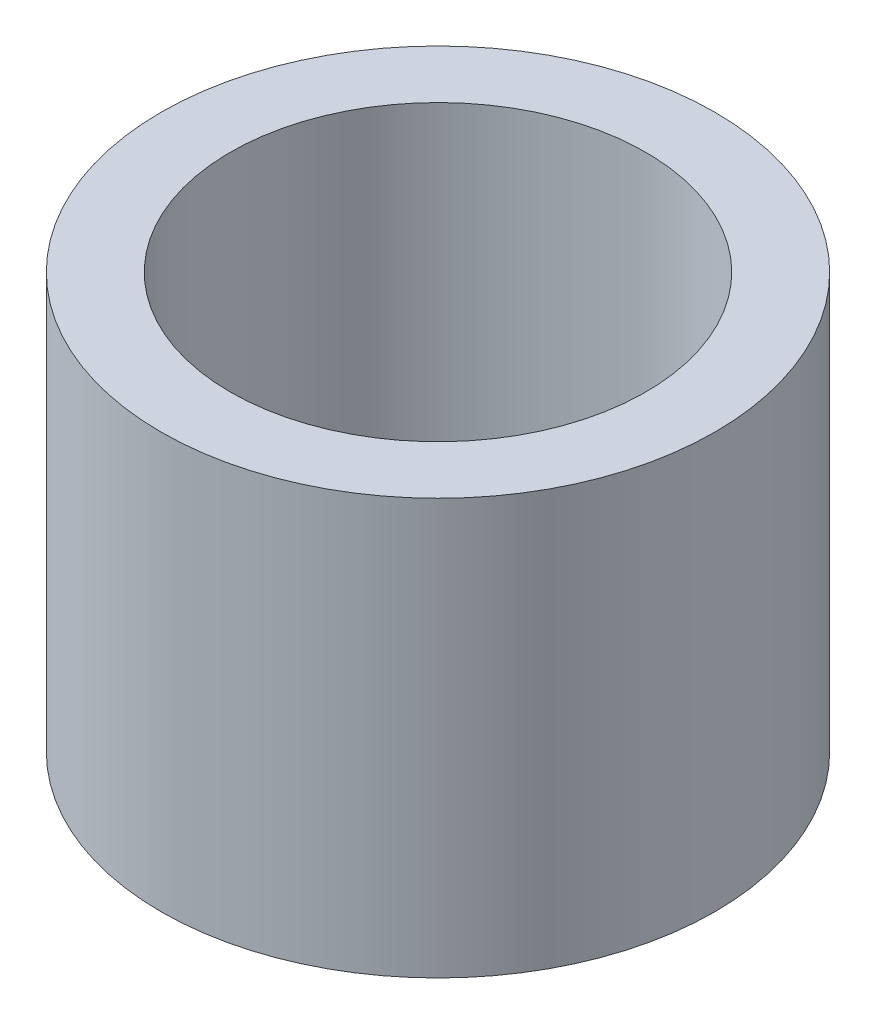
ISO-10303-21;
HEADER;
FILE_DESCRIPTION(('STEP AP214'),'2;1');
FILE_NAME('part.step','',(''),(''),'','','');
FILE_SCHEMA(('AUTOMOTIVE_DESIGN { 1 0 10303 214 1 1 1 1 }'));
ENDSEC;
DATA;
#1=APPLICATION_CONTEXT('core data for automotive mechanical design processes');
#2=APPLICATION_PROTOCOL_DEFINITION('international standard','automotive_design',2000,#1);
#3=PRODUCT_CONTEXT('',#1,'mechanical');
#4=PRODUCT('Part','Part','',(#3));
#5=PRODUCT_RELATED_PRODUCT_CATEGORY('part','',(#4));
#6=PRODUCT_DEFINITION_FORMATION('','',#4);
#7=PRODUCT_DEFINITION_CONTEXT('part definition',#1,'design');
#8=PRODUCT_DEFINITION('design','',#6,#7);
#9=PRODUCT_DEFINITION_SHAPE('','',#8);
#10=(LENGTH_UNIT() NAMED_UNIT(*) SI_UNIT(.MILLI.,.METRE.));
#11=(NAMED_UNIT(*) PLANE_ANGLE_UNIT() SI_UNIT($,.RADIAN.));
#12=(NAMED_UNIT(*) SI_UNIT($,.STERADIAN.) SOLID_ANGLE_UNIT());
#13=UNCERTAINTY_MEASURE_WITH_UNIT(LENGTH_MEASURE(1.E-05),#10,'distance_accuracy_value','');
#14=(GEOMETRIC_REPRESENTATION_CONTEXT(3) GLOBAL_UNCERTAINTY_ASSIGNED_CONTEXT((#13)) GLOBAL_UNIT_ASSIGNED_CONTEXT((#10,
#11,#12)) REPRESENTATION_CONTEXT('',''));
#15=CARTESIAN_POINT('',(0.,0.,0.));
#16=DIRECTION('',(0.,0.,1.));
#17=DIRECTION('',(1.,0.,0.));
#18=AXIS2_PLACEMENT_3D('',#15,#16,#17);
#19=CARTESIAN_POINT('',(-5.42511568942762,15.,-4.3107043035555));
#20=DIRECTION('',(0.,-1.,0.));
#21=DIRECTION('',(0.,0.,-1.));
#22=AXIS2_PLACEMENT_3D('',#19,#20,#21);
#23=CYLINDRICAL_SURFACE('',#22,10.);
#24=CARTESIAN_POINT('',(-5.42511568942762,15.,-4.3107043035555));
#25=DIRECTION('',(0.,1.,0.));
#26=DIRECTION('',(0.,0.,1.));
#27=AXIS2_PLACEMENT_3D('',#24,#25,#26);
#28=CIRCLE('',#27,10.);
#29=CARTESIAN_POINT('',(-5.42511568942762,15.,5.6892956964445));
#30=VERTEX_POINT('',#29);
#31=EDGE_CURVE('E10',#30,#30,#28,.T.);
#32=ORIENTED_EDGE('',*,*,#31,.F.);
#33=EDGE_LOOP('',(#32));
#34=FACE_BOUND('',#33,.T.);
#35=CARTESIAN_POINT('',(-5.42511568942762,0.,-4.3107043035555));
#36=DIRECTION('',(0.,1.,0.));
#37=DIRECTION('',(0.,0.,1.));
#38=AXIS2_PLACEMENT_3D('',#35,#36,#37);
#39=CIRCLE('',#38,10.);
#40=CARTESIAN_POINT('',(-5.42511568942762,0.,5.6892956964445));
#41=VERTEX_POINT('',#40);
#42=EDGE_CURVE('E44',#41,#41,#39,.T.);
#43=ORIENTED_EDGE('',*,*,#42,.T.);
#44=EDGE_LOOP('',(#43));
#45=FACE_BOUND('',#44,.T.);
#46=ADVANCED_FACE('F41',(#34,#45),#23,.T.);
#47=CARTESIAN_POINT('',(-5.42511568942762,15.,-4.3107043035555));
#48=DIRECTION('',(0.,1.,0.));
#49=DIRECTION('',(0.,0.,1.));
#50=AXIS2_PLACEMENT_3D('',#47,#48,#49);
#51=PLANE('',#50);
#52=CARTESIAN_POINT('',(-5.42511568942762,15.,-4.3107043035555));
#53=DIRECTION('',(0.,1.,0.));
#54=DIRECTION('',(0.,0.,1.));
#55=AXIS2_PLACEMENT_3D('',#52,#53,#54);
#56=CIRCLE('',#55,7.5);
#57=CARTESIAN_POINT('',(-5.42511568942762,15.,3.1892956964445));
#58=VERTEX_POINT('',#57);
#59=EDGE_CURVE('E55',#58,#58,#56,.T.);
#60=ORIENTED_EDGE('',*,*,#59,.F.);
#61=EDGE_LOOP('',(#60));
#62=FACE_BOUND('',#61,.T.);
#63=ORIENTED_EDGE('',*,*,#31,.T.);
#64=EDGE_LOOP('',(#63));
#65=FACE_BOUND('',#64,.T.);
#66=ADVANCED_FACE('F72',(#62,#65),#51,.T.);
#67=CARTESIAN_POINT('',(-5.42511568942762,0.,-4.3107043035555));
#68=DIRECTION('',(0.,1.,0.));
#69=DIRECTION('',(0.,0.,1.));
#70=AXIS2_PLACEMENT_3D('',#67,#68,#69);
#71=PLANE('',#70);
#72=ORIENTED_EDGE('',*,*,#42,.F.);
#73=EDGE_LOOP('',(#72));
#74=FACE_BOUND('',#73,.T.);
#75=ADVANCED_FACE('F68',(#74),#71,.F.);
#76=CARTESIAN_POINT('',(-5.42511568942762,2.5,-4.3107043035555));
#77=DIRECTION('',(0.,1.,0.));
#78=DIRECTION('',(0.,0.,1.));
#79=AXIS2_PLACEMENT_3D('',#76,#77,#78);
#80=CYLINDRICAL_SURFACE('',#79,7.5);
#81=CARTESIAN_POINT('',(-5.42511568942762,2.5,-4.3107043035555));
#82=DIRECTION('',(0.,1.,0.));
#83=DIRECTION('',(0.,0.,1.));
#84=AXIS2_PLACEMENT_3D('',#81,#82,#83);
#85=CIRCLE('',#84,7.5);
#86=CARTESIAN_POINT('',(-5.42511568942762,2.5,3.1892956964445));
#87=VERTEX_POINT('',#86);
#88=EDGE_CURVE('E53',#87,#87,#85,.T.);
#89=ORIENTED_EDGE('',*,*,#88,.F.);
#90=EDGE_LOOP('',(#89));
#91=FACE_BOUND('',#90,.T.);
#92=ORIENTED_EDGE('',*,*,#59,.T.);
#93=EDGE_LOOP('',(#92));
#94=FACE_BOUND('',#93,.T.);
#95=ADVANCED_FACE('F65',(#91,#94),#80,.F.);
#96=CARTESIAN_POINT('',(-5.42511568942762,2.5,-4.3107043035555));
#97=DIRECTION('',(0.,1.,0.));
#98=DIRECTION('',(0.,0.,1.));
#99=AXIS2_PLACEMENT_3D('',#96,#97,#98);
#100=PLANE('',#99);
#101=ORIENTED_EDGE('',*,*,#88,.T.);
#102=EDGE_LOOP('',(#101));
#103=FACE_BOUND('',#102,.T.);
#104=ADVANCED_FACE('F63',(#103),#100,.T.);
#105=CLOSED_SHELL('',(#46,#66,#75,#95,#104));
#106=MANIFOLD_SOLID_BREP('B2',#105);
#107=ADVANCED_BREP_SHAPE_REPRESENTATION('',(#18,#106),#14);
#108=SHAPE_DEFINITION_REPRESENTATION(#9,#107);
ENDSEC;
END-ISO-10303-21;
